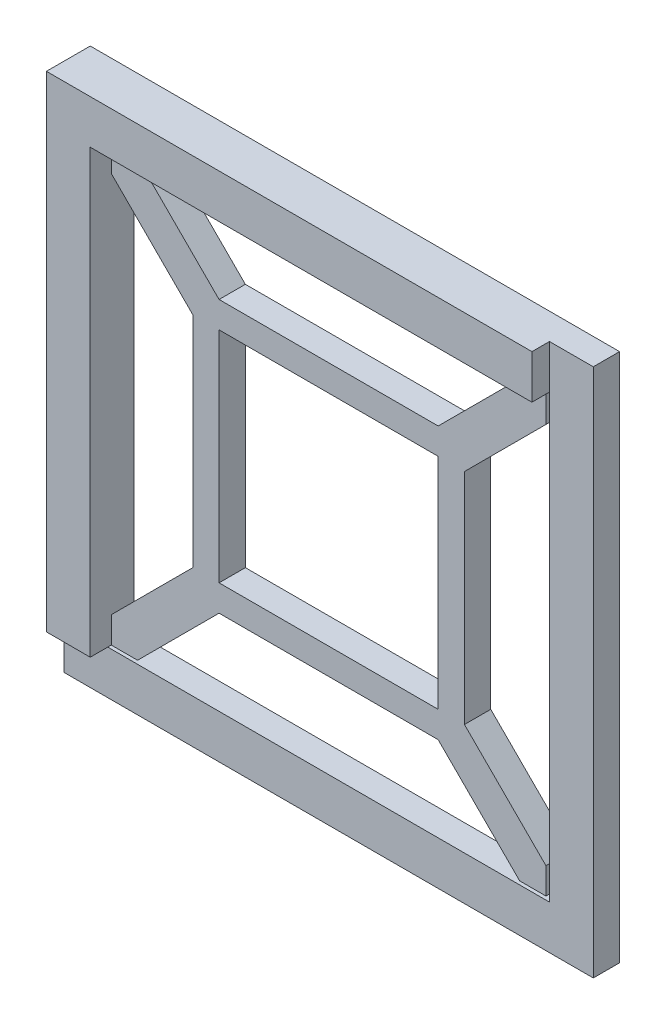
ISO-10303-21;
HEADER;
FILE_DESCRIPTION(('STEP AP214'),'2;1');
FILE_NAME('part.step','',(''),(''),'','','');
FILE_SCHEMA(('AUTOMOTIVE_DESIGN { 1 0 10303 214 1 1 1 1 }'));
ENDSEC;
DATA;
#1=APPLICATION_CONTEXT('core data for automotive mechanical design processes');
#2=APPLICATION_PROTOCOL_DEFINITION('international standard','automotive_design',2000,#1);
#3=PRODUCT_CONTEXT('',#1,'mechanical');
#4=PRODUCT('Part','Part','',(#3));
#5=PRODUCT_RELATED_PRODUCT_CATEGORY('part','',(#4));
#6=PRODUCT_DEFINITION_FORMATION('','',#4);
#7=PRODUCT_DEFINITION_CONTEXT('part definition',#1,'design');
#8=PRODUCT_DEFINITION('design','',#6,#7);
#9=PRODUCT_DEFINITION_SHAPE('','',#8);
#10=(LENGTH_UNIT() NAMED_UNIT(*) SI_UNIT(.MILLI.,.METRE.));
#11=(NAMED_UNIT(*) PLANE_ANGLE_UNIT() SI_UNIT($,.RADIAN.));
#12=(NAMED_UNIT(*) SI_UNIT($,.STERADIAN.) SOLID_ANGLE_UNIT());
#13=UNCERTAINTY_MEASURE_WITH_UNIT(LENGTH_MEASURE(1.E-05),#10,'distance_accuracy_value','');
#14=(GEOMETRIC_REPRESENTATION_CONTEXT(3) GLOBAL_UNCERTAINTY_ASSIGNED_CONTEXT((#13)) GLOBAL_UNIT_ASSIGNED_CONTEXT((#10,
#11,#12)) REPRESENTATION_CONTEXT('',''));
#15=CARTESIAN_POINT('',(0.,0.,0.));
#16=DIRECTION('',(0.,0.,1.));
#17=DIRECTION('',(1.,0.,0.));
#18=AXIS2_PLACEMENT_3D('',#15,#16,#17);
#19=CARTESIAN_POINT('',(0.,15.5,3.));
#20=DIRECTION('',(0.,1.,0.));
#21=DIRECTION('',(0.,0.,1.));
#22=AXIS2_PLACEMENT_3D('',#19,#20,#21);
#23=PLANE('',#22);
#24=DIRECTION('',(1.,0.,0.));
#25=VECTOR('',#24,1.);
#26=CARTESIAN_POINT('',(0.,15.5,3.));
#27=LINE('',#26,#25);
#28=CARTESIAN_POINT('',(-12.4999999999995,15.5,3.));
#29=VERTEX_POINT('',#28);
#30=CARTESIAN_POINT('',(12.5,15.5,3.));
#31=VERTEX_POINT('',#30);
#32=EDGE_CURVE('E381',#29,#31,#27,.T.);
#33=ORIENTED_EDGE('',*,*,#32,.T.);
#34=DIRECTION('',(0.,0.,-1.));
#35=VECTOR('',#34,1.);
#36=CARTESIAN_POINT('',(12.5,15.5,3.));
#37=LINE('',#36,#35);
#38=CARTESIAN_POINT('',(12.5,15.5,0.));
#39=VERTEX_POINT('',#38);
#40=EDGE_CURVE('E266',#31,#39,#37,.T.);
#41=ORIENTED_EDGE('',*,*,#40,.T.);
#42=DIRECTION('',(1.,0.,0.));
#43=VECTOR('',#42,1.);
#44=CARTESIAN_POINT('',(0.,15.5,0.));
#45=LINE('',#44,#43);
#46=CARTESIAN_POINT('',(-12.4999999999995,15.5,0.));
#47=VERTEX_POINT('',#46);
#48=EDGE_CURVE('E391',#47,#39,#45,.T.);
#49=ORIENTED_EDGE('',*,*,#48,.F.);
#50=DIRECTION('',(0.,0.,-1.));
#51=VECTOR('',#50,1.);
#52=CARTESIAN_POINT('',(-12.4999999999995,15.5,3.));
#53=LINE('',#52,#51);
#54=EDGE_CURVE('E325',#29,#47,#53,.T.);
#55=ORIENTED_EDGE('',*,*,#54,.F.);
#56=EDGE_LOOP('',(#33,#41,#49,#55));
#57=FACE_BOUND('',#56,.T.);
#58=ADVANCED_FACE('F93',(#57),#23,.T.);
#59=CARTESIAN_POINT('',(-15.5,0.,3.));
#60=DIRECTION('',(-1.,0.,0.));
#61=DIRECTION('',(0.,0.,1.));
#62=AXIS2_PLACEMENT_3D('',#59,#60,#61);
#63=PLANE('',#62);
#64=DIRECTION('',(0.,1.,0.));
#65=VECTOR('',#64,1.);
#66=CARTESIAN_POINT('',(-15.5,0.,3.));
#67=LINE('',#66,#65);
#68=CARTESIAN_POINT('',(-15.5,-12.4999999999995,3.));
#69=VERTEX_POINT('',#68);
#70=CARTESIAN_POINT('',(-15.5,12.5000000000005,3.));
#71=VERTEX_POINT('',#70);
#72=EDGE_CURVE('E379',#69,#71,#67,.T.);
#73=ORIENTED_EDGE('',*,*,#72,.T.);
#74=DIRECTION('',(0.,0.,-1.));
#75=VECTOR('',#74,1.);
#76=CARTESIAN_POINT('',(-15.5,12.5000000000005,3.));
#77=LINE('',#76,#75);
#78=CARTESIAN_POINT('',(-15.5,12.5000000000005,0.));
#79=VERTEX_POINT('',#78);
#80=EDGE_CURVE('E327',#71,#79,#77,.T.);
#81=ORIENTED_EDGE('',*,*,#80,.T.);
#82=DIRECTION('',(0.,1.,0.));
#83=VECTOR('',#82,1.);
#84=CARTESIAN_POINT('',(-15.5,0.,0.));
#85=LINE('',#84,#83);
#86=CARTESIAN_POINT('',(-15.5,-12.4999999999995,0.));
#87=VERTEX_POINT('',#86);
#88=EDGE_CURVE('E373',#87,#79,#85,.T.);
#89=ORIENTED_EDGE('',*,*,#88,.F.);
#90=DIRECTION('',(0.,0.,-1.));
#91=VECTOR('',#90,1.);
#92=CARTESIAN_POINT('',(-15.5,-12.4999999999995,3.));
#93=LINE('',#92,#91);
#94=EDGE_CURVE('E116',#69,#87,#93,.T.);
#95=ORIENTED_EDGE('',*,*,#94,.F.);
#96=EDGE_LOOP('',(#73,#81,#89,#95));
#97=FACE_BOUND('',#96,.T.);
#98=ADVANCED_FACE('F503',(#97),#63,.T.);
#99=CARTESIAN_POINT('',(0.,-15.5,3.));
#100=DIRECTION('',(0.,1.,0.));
#101=DIRECTION('',(-1.,0.,0.));
#102=AXIS2_PLACEMENT_3D('',#99,#100,#101);
#103=PLANE('',#102);
#104=DIRECTION('',(0.,0.,1.));
#105=VECTOR('',#104,1.);
#106=CARTESIAN_POINT('',(-12.5000000000005,-15.5,3.));
#107=LINE('',#106,#105);
#108=CARTESIAN_POINT('',(-12.5000000000005,-15.5,0.));
#109=VERTEX_POINT('',#108);
#110=CARTESIAN_POINT('',(-12.5000000000005,-15.5,3.));
#111=VERTEX_POINT('',#110);
#112=EDGE_CURVE('E101',#109,#111,#107,.T.);
#113=ORIENTED_EDGE('',*,*,#112,.F.);
#114=DIRECTION('',(1.,0.,0.));
#115=VECTOR('',#114,1.);
#116=CARTESIAN_POINT('',(0.,-15.5,0.));
#117=LINE('',#116,#115);
#118=CARTESIAN_POINT('',(12.4999999999999,-15.5,0.));
#119=VERTEX_POINT('',#118);
#120=EDGE_CURVE('E382',#109,#119,#117,.T.);
#121=ORIENTED_EDGE('',*,*,#120,.T.);
#122=DIRECTION('',(0.,0.,-1.));
#123=VECTOR('',#122,1.);
#124=CARTESIAN_POINT('',(12.4999999999999,-15.5,3.));
#125=LINE('',#124,#123);
#126=CARTESIAN_POINT('',(12.4999999999999,-15.5,3.));
#127=VERTEX_POINT('',#126);
#128=EDGE_CURVE('E398',#127,#119,#125,.T.);
#129=ORIENTED_EDGE('',*,*,#128,.F.);
#130=DIRECTION('',(1.,0.,0.));
#131=VECTOR('',#130,1.);
#132=CARTESIAN_POINT('',(0.,-15.5,3.));
#133=LINE('',#132,#131);
#134=EDGE_CURVE('E386',#111,#127,#133,.T.);
#135=ORIENTED_EDGE('',*,*,#134,.F.);
#136=EDGE_LOOP('',(#113,#121,#129,#135));
#137=FACE_BOUND('',#136,.T.);
#138=ADVANCED_FACE('F461',(#137),#103,.F.);
#139=CARTESIAN_POINT('',(-1.50000000000007,-1.50000000000006,3.));
#140=DIRECTION('',(-0.707106781186548,-0.707106781186547,0.));
#141=DIRECTION('',(0.707106781186547,-0.707106781186548,0.));
#142=AXIS2_PLACEMENT_3D('',#139,#140,#141);
#143=PLANE('',#142);
#144=DIRECTION('',(-0.707106781186547,0.707106781186548,0.));
#145=VECTOR('',#144,1.);
#146=CARTESIAN_POINT('',(-1.50000000000007,-1.50000000000006,3.));
#147=LINE('',#146,#145);
#148=CARTESIAN_POINT('',(21.7999999999998,-24.8,3.));
#149=VERTEX_POINT('',#148);
#150=EDGE_CURVE('E402',#149,#127,#147,.T.);
#151=ORIENTED_EDGE('',*,*,#150,.T.);
#152=ORIENTED_EDGE('',*,*,#128,.T.);
#153=DIRECTION('',(-0.707106781186547,0.707106781186548,0.));
#154=VECTOR('',#153,1.);
#155=CARTESIAN_POINT('',(-1.50000000000007,-1.50000000000006,0.));
#156=LINE('',#155,#154);
#157=CARTESIAN_POINT('',(21.7999999999998,-24.8,0.));
#158=VERTEX_POINT('',#157);
#159=EDGE_CURVE('E401',#158,#119,#156,.T.);
#160=ORIENTED_EDGE('',*,*,#159,.F.);
#161=DIRECTION('',(0.,0.,-1.));
#162=VECTOR('',#161,1.);
#163=CARTESIAN_POINT('',(21.7999999999998,-24.8,3.));
#164=LINE('',#163,#162);
#165=EDGE_CURVE('E438',#149,#158,#164,.T.);
#166=ORIENTED_EDGE('',*,*,#165,.F.);
#167=EDGE_LOOP('',(#151,#152,#160,#166));
#168=FACE_BOUND('',#167,.T.);
#169=ADVANCED_FACE('F95',(#168),#143,.T.);
#170=CARTESIAN_POINT('',(1.49999999999994,1.49999999999994,3.));
#171=DIRECTION('',(-0.707106781186548,-0.707106781186547,0.));
#172=DIRECTION('',(0.707106781186547,-0.707106781186548,0.));
#173=AXIS2_PLACEMENT_3D('',#170,#171,#172);
#174=PLANE('',#173);
#175=DIRECTION('',(0.,0.,-1.));
#176=VECTOR('',#175,1.);
#177=CARTESIAN_POINT('',(15.5,-12.5000000000001,3.));
#178=LINE('',#177,#176);
#179=CARTESIAN_POINT('',(15.5,-12.5000000000001,3.));
#180=VERTEX_POINT('',#179);
#181=CARTESIAN_POINT('',(15.5,-12.5000000000001,0.));
#182=VERTEX_POINT('',#181);
#183=EDGE_CURVE('E388',#180,#182,#178,.T.);
#184=ORIENTED_EDGE('',*,*,#183,.F.);
#185=DIRECTION('',(-0.707106781186547,0.707106781186548,0.));
#186=VECTOR('',#185,1.);
#187=CARTESIAN_POINT('',(1.49999999999994,1.49999999999994,3.));
#188=LINE('',#187,#186);
#189=CARTESIAN_POINT('',(24.8,-21.8000000000001,3.));
#190=VERTEX_POINT('',#189);
#191=EDGE_CURVE('E411',#190,#180,#188,.T.);
#192=ORIENTED_EDGE('',*,*,#191,.F.);
#193=DIRECTION('',(0.,0.,-1.));
#194=VECTOR('',#193,1.);
#195=CARTESIAN_POINT('',(24.8,-21.8000000000001,3.));
#196=LINE('',#195,#194);
#197=CARTESIAN_POINT('',(24.8,-21.8000000000001,0.));
#198=VERTEX_POINT('',#197);
#199=EDGE_CURVE('E434',#190,#198,#196,.T.);
#200=ORIENTED_EDGE('',*,*,#199,.T.);
#201=DIRECTION('',(-0.707106781186547,0.707106781186548,0.));
#202=VECTOR('',#201,1.);
#203=CARTESIAN_POINT('',(1.49999999999994,1.49999999999994,0.));
#204=LINE('',#203,#202);
#205=EDGE_CURVE('E426',#198,#182,#204,.T.);
#206=ORIENTED_EDGE('',*,*,#205,.T.);
#207=EDGE_LOOP('',(#184,#192,#200,#206));
#208=FACE_BOUND('',#207,.T.);
#209=ADVANCED_FACE('F475',(#208),#174,.F.);
#210=CARTESIAN_POINT('',(0.,-24.8,3.));
#211=DIRECTION('',(0.,1.,0.));
#212=DIRECTION('',(0.,0.,1.));
#213=AXIS2_PLACEMENT_3D('',#210,#211,#212);
#214=PLANE('',#213);
#215=DIRECTION('',(1.,0.,0.));
#216=VECTOR('',#215,1.);
#217=CARTESIAN_POINT('',(0.,-24.8,0.));
#218=LINE('',#217,#216);
#219=CARTESIAN_POINT('',(24.8,-24.8,0.));
#220=VERTEX_POINT('',#219);
#221=EDGE_CURVE('E420',#158,#220,#218,.T.);
#222=ORIENTED_EDGE('',*,*,#221,.T.);
#223=DIRECTION('',(0.,0.,-1.));
#224=VECTOR('',#223,1.);
#225=CARTESIAN_POINT('',(24.8,-24.8,3.));
#226=LINE('',#225,#224);
#227=CARTESIAN_POINT('',(24.8,-24.8,3.));
#228=VERTEX_POINT('',#227);
#229=EDGE_CURVE('E436',#228,#220,#226,.T.);
#230=ORIENTED_EDGE('',*,*,#229,.F.);
#231=DIRECTION('',(1.,0.,0.));
#232=VECTOR('',#231,1.);
#233=CARTESIAN_POINT('',(0.,-24.8,3.));
#234=LINE('',#233,#232);
#235=EDGE_CURVE('E405',#149,#228,#234,.T.);
#236=ORIENTED_EDGE('',*,*,#235,.F.);
#237=ORIENTED_EDGE('',*,*,#165,.T.);
#238=EDGE_LOOP('',(#222,#230,#236,#237));
#239=FACE_BOUND('',#238,.T.);
#240=ADVANCED_FACE('F467',(#239),#214,.F.);
#241=CARTESIAN_POINT('',(24.8,0.,3.));
#242=DIRECTION('',(1.,0.,0.));
#243=DIRECTION('',(0.,1.,0.));
#244=AXIS2_PLACEMENT_3D('',#241,#242,#243);
#245=PLANE('',#244);
#246=DIRECTION('',(0.,-1.,0.));
#247=VECTOR('',#246,1.);
#248=CARTESIAN_POINT('',(24.8,0.,0.));
#249=LINE('',#248,#247);
#250=EDGE_CURVE('E423',#198,#220,#249,.T.);
#251=ORIENTED_EDGE('',*,*,#250,.F.);
#252=ORIENTED_EDGE('',*,*,#199,.F.);
#253=DIRECTION('',(0.,-1.,0.));
#254=VECTOR('',#253,1.);
#255=CARTESIAN_POINT('',(24.8,0.,3.));
#256=LINE('',#255,#254);
#257=EDGE_CURVE('E408',#190,#228,#256,.T.);
#258=ORIENTED_EDGE('',*,*,#257,.T.);
#259=ORIENTED_EDGE('',*,*,#229,.T.);
#260=EDGE_LOOP('',(#251,#252,#258,#259));
#261=FACE_BOUND('',#260,.T.);
#262=ADVANCED_FACE('F470',(#261),#245,.T.);
#263=CARTESIAN_POINT('',(12.5,0.,3.));
#264=DIRECTION('',(-1.,0.,0.));
#265=DIRECTION('',(0.,0.,1.));
#266=AXIS2_PLACEMENT_3D('',#263,#264,#265);
#267=PLANE('',#266);
#268=DIRECTION('',(0.,1.,0.));
#269=VECTOR('',#268,1.);
#270=CARTESIAN_POINT('',(12.5,0.,3.));
#271=LINE('',#270,#269);
#272=CARTESIAN_POINT('',(12.5,-12.5,3.));
#273=VERTEX_POINT('',#272);
#274=CARTESIAN_POINT('',(12.5,12.5,3.));
#275=VERTEX_POINT('',#274);
#276=EDGE_CURVE('E413',#273,#275,#271,.T.);
#277=ORIENTED_EDGE('',*,*,#276,.T.);
#278=DIRECTION('',(0.,0.,-1.));
#279=VECTOR('',#278,1.);
#280=CARTESIAN_POINT('',(12.5,12.5,3.));
#281=LINE('',#280,#279);
#282=CARTESIAN_POINT('',(12.5,12.5,0.));
#283=VERTEX_POINT('',#282);
#284=EDGE_CURVE('E374',#275,#283,#281,.T.);
#285=ORIENTED_EDGE('',*,*,#284,.T.);
#286=DIRECTION('',(0.,1.,0.));
#287=VECTOR('',#286,1.);
#288=CARTESIAN_POINT('',(12.5,0.,0.));
#289=LINE('',#288,#287);
#290=CARTESIAN_POINT('',(12.5,-12.5,0.));
#291=VERTEX_POINT('',#290);
#292=EDGE_CURVE('E429',#291,#283,#289,.T.);
#293=ORIENTED_EDGE('',*,*,#292,.F.);
#294=DIRECTION('',(0.,0.,-1.));
#295=VECTOR('',#294,1.);
#296=CARTESIAN_POINT('',(12.5,-12.5,3.));
#297=LINE('',#296,#295);
#298=EDGE_CURVE('E417',#273,#291,#297,.T.);
#299=ORIENTED_EDGE('',*,*,#298,.F.);
#300=EDGE_LOOP('',(#277,#285,#293,#299));
#301=FACE_BOUND('',#300,.T.);
#302=ADVANCED_FACE('F534',(#301),#267,.T.);
#303=CARTESIAN_POINT('',(0.,-12.5,3.));
#304=DIRECTION('',(0.,1.,0.));
#305=DIRECTION('',(-1.,0.,0.));
#306=AXIS2_PLACEMENT_3D('',#303,#304,#305);
#307=PLANE('',#306);
#308=DIRECTION('',(1.,0.,0.));
#309=VECTOR('',#308,1.);
#310=CARTESIAN_POINT('',(0.,-12.5,3.));
#311=LINE('',#310,#309);
#312=CARTESIAN_POINT('',(-12.5,-12.5,3.));
#313=VERTEX_POINT('',#312);
#314=EDGE_CURVE('E415',#313,#273,#311,.T.);
#315=ORIENTED_EDGE('',*,*,#314,.T.);
#316=ORIENTED_EDGE('',*,*,#298,.T.);
#317=DIRECTION('',(1.,0.,0.));
#318=VECTOR('',#317,1.);
#319=CARTESIAN_POINT('',(0.,-12.5,0.));
#320=LINE('',#319,#318);
#321=CARTESIAN_POINT('',(-12.5,-12.5,0.));
#322=VERTEX_POINT('',#321);
#323=EDGE_CURVE('E406',#322,#291,#320,.T.);
#324=ORIENTED_EDGE('',*,*,#323,.F.);
#325=DIRECTION('',(0.,0.,-1.));
#326=VECTOR('',#325,1.);
#327=CARTESIAN_POINT('',(-12.5,-12.5,3.));
#328=LINE('',#327,#326);
#329=EDGE_CURVE('E370',#313,#322,#328,.T.);
#330=ORIENTED_EDGE('',*,*,#329,.F.);
#331=EDGE_LOOP('',(#315,#316,#324,#330));
#332=FACE_BOUND('',#331,.T.);
#333=ADVANCED_FACE('F529',(#332),#307,.T.);
#334=CARTESIAN_POINT('',(0.,0.,3.));
#335=DIRECTION('',(0.,0.,1.));
#336=DIRECTION('',(1.,0.,0.));
#337=AXIS2_PLACEMENT_3D('',#334,#335,#336);
#338=PLANE('',#337);
#339=DIRECTION('',(0.,1.,0.));
#340=VECTOR('',#339,1.);
#341=CARTESIAN_POINT('',(15.5,0.,3.));
#342=LINE('',#341,#340);
#343=CARTESIAN_POINT('',(15.5,12.5,3.));
#344=VERTEX_POINT('',#343);
#345=EDGE_CURVE('E278',#180,#344,#342,.T.);
#346=ORIENTED_EDGE('',*,*,#345,.T.);
#347=DIRECTION('',(-0.707106781186547,-0.707106781186548,0.));
#348=VECTOR('',#347,1.);
#349=CARTESIAN_POINT('',(1.5,-1.5,3.));
#350=LINE('',#349,#348);
#351=CARTESIAN_POINT('',(24.8,21.8,3.));
#352=VERTEX_POINT('',#351);
#353=EDGE_CURVE('E259',#352,#344,#350,.T.);
#354=ORIENTED_EDGE('',*,*,#353,.F.);
#355=DIRECTION('',(0.,-1.,0.));
#356=VECTOR('',#355,1.);
#357=CARTESIAN_POINT('',(24.8,0.,3.));
#358=LINE('',#357,#356);
#359=CARTESIAN_POINT('',(24.8,24.8,3.));
#360=VERTEX_POINT('',#359);
#361=EDGE_CURVE('E275',#360,#352,#358,.T.);
#362=ORIENTED_EDGE('',*,*,#361,.F.);
#363=DIRECTION('',(1.,0.,0.));
#364=VECTOR('',#363,1.);
#365=CARTESIAN_POINT('',(0.,24.8,3.));
#366=LINE('',#365,#364);
#367=CARTESIAN_POINT('',(21.8,24.8,3.));
#368=VERTEX_POINT('',#367);
#369=EDGE_CURVE('E282',#368,#360,#366,.T.);
#370=ORIENTED_EDGE('',*,*,#369,.F.);
#371=DIRECTION('',(-0.707106781186548,-0.707106781186547,0.));
#372=VECTOR('',#371,1.);
#373=CARTESIAN_POINT('',(-1.50000000000001,1.50000000000001,3.));
#374=LINE('',#373,#372);
#375=EDGE_CURVE('E284',#368,#31,#374,.T.);
#376=ORIENTED_EDGE('',*,*,#375,.T.);
#377=ORIENTED_EDGE('',*,*,#32,.F.);
#378=DIRECTION('',(0.707106781186547,-0.707106781186548,0.));
#379=VECTOR('',#378,1.);
#380=CARTESIAN_POINT('',(1.50000000000022,1.50000000000022,3.));
#381=LINE('',#380,#379);
#382=CARTESIAN_POINT('',(-21.7999999999995,24.8,3.));
#383=VERTEX_POINT('',#382);
#384=EDGE_CURVE('E301',#383,#29,#381,.T.);
#385=ORIENTED_EDGE('',*,*,#384,.F.);
#386=DIRECTION('',(1.,0.,0.));
#387=VECTOR('',#386,1.);
#388=CARTESIAN_POINT('',(0.,24.8,3.));
#389=LINE('',#388,#387);
#390=CARTESIAN_POINT('',(-24.8,24.8,3.));
#391=VERTEX_POINT('',#390);
#392=EDGE_CURVE('E303',#391,#383,#389,.T.);
#393=ORIENTED_EDGE('',*,*,#392,.F.);
#394=DIRECTION('',(0.,-1.,0.));
#395=VECTOR('',#394,1.);
#396=CARTESIAN_POINT('',(-24.8,0.,3.));
#397=LINE('',#396,#395);
#398=CARTESIAN_POINT('',(-24.8,21.8000000000005,3.));
#399=VERTEX_POINT('',#398);
#400=EDGE_CURVE('E307',#391,#399,#397,.T.);
#401=ORIENTED_EDGE('',*,*,#400,.T.);
#402=DIRECTION('',(0.707106781186547,-0.707106781186548,0.));
#403=VECTOR('',#402,1.);
#404=CARTESIAN_POINT('',(-1.49999999999979,-1.49999999999978,3.));
#405=LINE('',#404,#403);
#406=EDGE_CURVE('E309',#399,#71,#405,.T.);
#407=ORIENTED_EDGE('',*,*,#406,.T.);
#408=ORIENTED_EDGE('',*,*,#72,.F.);
#409=DIRECTION('',(0.707106781186539,0.707106781186556,0.));
#410=VECTOR('',#409,1.);
#411=CARTESIAN_POINT('',(-1.50000000000046,1.50000000000042,3.));
#412=LINE('',#411,#410);
#413=CARTESIAN_POINT('',(-24.8,-21.7999999999997,3.));
#414=VERTEX_POINT('',#413);
#415=EDGE_CURVE('E331',#414,#69,#412,.T.);
#416=ORIENTED_EDGE('',*,*,#415,.F.);
#417=DIRECTION('',(0.,-1.,0.));
#418=VECTOR('',#417,1.);
#419=CARTESIAN_POINT('',(-24.8,0.,3.));
#420=LINE('',#419,#418);
#421=CARTESIAN_POINT('',(-24.8,-24.8,3.));
#422=VERTEX_POINT('',#421);
#423=EDGE_CURVE('E334',#414,#422,#420,.T.);
#424=ORIENTED_EDGE('',*,*,#423,.T.);
#425=DIRECTION('',(1.,0.,0.));
#426=VECTOR('',#425,1.);
#427=CARTESIAN_POINT('',(0.,-24.8,3.));
#428=LINE('',#427,#426);
#429=CARTESIAN_POINT('',(-21.8000000000003,-24.8,3.));
#430=VERTEX_POINT('',#429);
#431=EDGE_CURVE('E337',#422,#430,#428,.T.);
#432=ORIENTED_EDGE('',*,*,#431,.T.);
#433=DIRECTION('',(0.707106781186539,0.707106781186556,0.));
#434=VECTOR('',#433,1.);
#435=CARTESIAN_POINT('',(1.49999999999958,-1.49999999999954,3.));
#436=LINE('',#435,#434);
#437=EDGE_CURVE('E339',#430,#111,#436,.T.);
#438=ORIENTED_EDGE('',*,*,#437,.T.);
#439=ORIENTED_EDGE('',*,*,#134,.T.);
#440=ORIENTED_EDGE('',*,*,#150,.F.);
#441=ORIENTED_EDGE('',*,*,#235,.T.);
#442=ORIENTED_EDGE('',*,*,#257,.F.);
#443=ORIENTED_EDGE('',*,*,#191,.T.);
#444=EDGE_LOOP('',(#346,#354,#362,#370,#376,#377,#385,#393,#401,#407,#408,#416,#424,#432,#438,
#439,#440,#441,#442,#443));
#445=FACE_BOUND('',#444,.T.);
#446=DIRECTION('',(1.,0.,0.));
#447=VECTOR('',#446,1.);
#448=CARTESIAN_POINT('',(-12.5,12.5,3.));
#449=LINE('',#448,#447);
#450=CARTESIAN_POINT('',(-12.5,12.5,3.));
#451=VERTEX_POINT('',#450);
#452=EDGE_CURVE('E362',#451,#275,#449,.T.);
#453=ORIENTED_EDGE('',*,*,#452,.T.);
#454=ORIENTED_EDGE('',*,*,#276,.F.);
#455=ORIENTED_EDGE('',*,*,#314,.F.);
#456=DIRECTION('',(0.,1.,0.));
#457=VECTOR('',#456,1.);
#458=CARTESIAN_POINT('',(-12.5,-12.5,3.));
#459=LINE('',#458,#457);
#460=EDGE_CURVE('E360',#313,#451,#459,.T.);
#461=ORIENTED_EDGE('',*,*,#460,.T.);
#462=EDGE_LOOP('',(#453,#454,#455,#461));
#463=FACE_BOUND('',#462,.T.);
#464=ADVANCED_FACE('F272',(#445,#463),#338,.T.);
#465=CARTESIAN_POINT('',(0.,0.,0.));
#466=DIRECTION('',(0.,0.,1.));
#467=DIRECTION('',(1.,0.,0.));
#468=AXIS2_PLACEMENT_3D('',#465,#466,#467);
#469=PLANE('',#468);
#470=DIRECTION('',(-0.707106781186547,-0.707106781186548,0.));
#471=VECTOR('',#470,1.);
#472=CARTESIAN_POINT('',(1.5,-1.5,0.));
#473=LINE('',#472,#471);
#474=CARTESIAN_POINT('',(24.8,21.8,0.));
#475=VERTEX_POINT('',#474);
#476=CARTESIAN_POINT('',(15.5,12.5,0.));
#477=VERTEX_POINT('',#476);
#478=EDGE_CURVE('E261',#475,#477,#473,.T.);
#479=ORIENTED_EDGE('',*,*,#478,.T.);
#480=DIRECTION('',(0.,1.,0.));
#481=VECTOR('',#480,1.);
#482=CARTESIAN_POINT('',(15.5,0.,0.));
#483=LINE('',#482,#481);
#484=EDGE_CURVE('E393',#182,#477,#483,.T.);
#485=ORIENTED_EDGE('',*,*,#484,.F.);
#486=ORIENTED_EDGE('',*,*,#205,.F.);
#487=ORIENTED_EDGE('',*,*,#250,.T.);
#488=ORIENTED_EDGE('',*,*,#221,.F.);
#489=ORIENTED_EDGE('',*,*,#159,.T.);
#490=ORIENTED_EDGE('',*,*,#120,.F.);
#491=DIRECTION('',(0.707106781186539,0.707106781186556,0.));
#492=VECTOR('',#491,1.);
#493=CARTESIAN_POINT('',(1.49999999999958,-1.49999999999954,0.));
#494=LINE('',#493,#492);
#495=CARTESIAN_POINT('',(-21.8000000000003,-24.8,0.));
#496=VERTEX_POINT('',#495);
#497=EDGE_CURVE('E335',#496,#109,#494,.T.);
#498=ORIENTED_EDGE('',*,*,#497,.F.);
#499=DIRECTION('',(1.,0.,0.));
#500=VECTOR('',#499,1.);
#501=CARTESIAN_POINT('',(0.,-24.8,0.));
#502=LINE('',#501,#500);
#503=CARTESIAN_POINT('',(-24.8,-24.8,0.));
#504=VERTEX_POINT('',#503);
#505=EDGE_CURVE('E347',#504,#496,#502,.T.);
#506=ORIENTED_EDGE('',*,*,#505,.F.);
#507=DIRECTION('',(0.,-1.,0.));
#508=VECTOR('',#507,1.);
#509=CARTESIAN_POINT('',(-24.8,0.,0.));
#510=LINE('',#509,#508);
#511=CARTESIAN_POINT('',(-24.8,-21.7999999999997,0.));
#512=VERTEX_POINT('',#511);
#513=EDGE_CURVE('E345',#512,#504,#510,.T.);
#514=ORIENTED_EDGE('',*,*,#513,.F.);
#515=DIRECTION('',(0.707106781186539,0.707106781186556,0.));
#516=VECTOR('',#515,1.);
#517=CARTESIAN_POINT('',(-1.50000000000046,1.50000000000042,0.));
#518=LINE('',#517,#516);
#519=EDGE_CURVE('E330',#512,#87,#518,.T.);
#520=ORIENTED_EDGE('',*,*,#519,.T.);
#521=ORIENTED_EDGE('',*,*,#88,.T.);
#522=DIRECTION('',(0.707106781186547,-0.707106781186548,0.));
#523=VECTOR('',#522,1.);
#524=CARTESIAN_POINT('',(-1.49999999999979,-1.49999999999978,0.));
#525=LINE('',#524,#523);
#526=CARTESIAN_POINT('',(-24.8,21.8000000000005,0.));
#527=VERTEX_POINT('',#526);
#528=EDGE_CURVE('E304',#527,#79,#525,.T.);
#529=ORIENTED_EDGE('',*,*,#528,.F.);
#530=DIRECTION('',(0.,-1.,0.));
#531=VECTOR('',#530,1.);
#532=CARTESIAN_POINT('',(-24.8,0.,0.));
#533=LINE('',#532,#531);
#534=CARTESIAN_POINT('',(-24.8,24.8,0.));
#535=VERTEX_POINT('',#534);
#536=EDGE_CURVE('E316',#535,#527,#533,.T.);
#537=ORIENTED_EDGE('',*,*,#536,.F.);
#538=DIRECTION('',(1.,0.,0.));
#539=VECTOR('',#538,1.);
#540=CARTESIAN_POINT('',(0.,24.8,0.));
#541=LINE('',#540,#539);
#542=CARTESIAN_POINT('',(-21.7999999999995,24.8,0.));
#543=VERTEX_POINT('',#542);
#544=EDGE_CURVE('E314',#535,#543,#541,.T.);
#545=ORIENTED_EDGE('',*,*,#544,.T.);
#546=DIRECTION('',(0.707106781186547,-0.707106781186548,0.));
#547=VECTOR('',#546,1.);
#548=CARTESIAN_POINT('',(1.50000000000022,1.50000000000022,0.));
#549=LINE('',#548,#547);
#550=EDGE_CURVE('E108',#543,#47,#549,.T.);
#551=ORIENTED_EDGE('',*,*,#550,.T.);
#552=ORIENTED_EDGE('',*,*,#48,.T.);
#553=DIRECTION('',(-0.707106781186548,-0.707106781186547,0.));
#554=VECTOR('',#553,1.);
#555=CARTESIAN_POINT('',(-1.50000000000001,1.50000000000001,0.));
#556=LINE('',#555,#554);
#557=CARTESIAN_POINT('',(21.8,24.8,0.));
#558=VERTEX_POINT('',#557);
#559=EDGE_CURVE('E279',#558,#39,#556,.T.);
#560=ORIENTED_EDGE('',*,*,#559,.F.);
#561=DIRECTION('',(1.,0.,0.));
#562=VECTOR('',#561,1.);
#563=CARTESIAN_POINT('',(0.,24.8,0.));
#564=LINE('',#563,#562);
#565=CARTESIAN_POINT('',(24.8,24.8,0.));
#566=VERTEX_POINT('',#565);
#567=EDGE_CURVE('E293',#558,#566,#564,.T.);
#568=ORIENTED_EDGE('',*,*,#567,.T.);
#569=DIRECTION('',(0.,-1.,0.));
#570=VECTOR('',#569,1.);
#571=CARTESIAN_POINT('',(24.8,0.,0.));
#572=LINE('',#571,#570);
#573=EDGE_CURVE('E291',#566,#475,#572,.T.);
#574=ORIENTED_EDGE('',*,*,#573,.T.);
#575=EDGE_LOOP('',(#479,#485,#486,#487,#488,#489,#490,#498,#506,#514,#520,#521,#529,#537,#545,
#551,#552,#560,#568,#574));
#576=FACE_BOUND('',#575,.T.);
#577=ORIENTED_EDGE('',*,*,#292,.T.);
#578=DIRECTION('',(1.,0.,0.));
#579=VECTOR('',#578,1.);
#580=CARTESIAN_POINT('',(-12.5,12.5,0.));
#581=LINE('',#580,#579);
#582=CARTESIAN_POINT('',(-12.5,12.5,0.));
#583=VERTEX_POINT('',#582);
#584=EDGE_CURVE('E363',#583,#283,#581,.T.);
#585=ORIENTED_EDGE('',*,*,#584,.F.);
#586=DIRECTION('',(0.,1.,0.));
#587=VECTOR('',#586,1.);
#588=CARTESIAN_POINT('',(-12.5,-12.5,0.));
#589=LINE('',#588,#587);
#590=EDGE_CURVE('E359',#322,#583,#589,.T.);
#591=ORIENTED_EDGE('',*,*,#590,.F.);
#592=ORIENTED_EDGE('',*,*,#323,.T.);
#593=EDGE_LOOP('',(#577,#585,#591,#592));
#594=FACE_BOUND('',#593,.T.);
#595=ADVANCED_FACE('F455',(#576,#594),#469,.F.);
#596=CARTESIAN_POINT('',(15.5,0.,3.));
#597=DIRECTION('',(-1.,0.,0.));
#598=DIRECTION('',(0.,0.,1.));
#599=AXIS2_PLACEMENT_3D('',#596,#597,#598);
#600=PLANE('',#599);
#601=ORIENTED_EDGE('',*,*,#484,.T.);
#602=DIRECTION('',(0.,0.,1.));
#603=VECTOR('',#602,1.);
#604=CARTESIAN_POINT('',(15.5,12.5,3.));
#605=LINE('',#604,#603);
#606=EDGE_CURVE('E13',#477,#344,#605,.T.);
#607=ORIENTED_EDGE('',*,*,#606,.T.);
#608=ORIENTED_EDGE('',*,*,#345,.F.);
#609=ORIENTED_EDGE('',*,*,#183,.T.);
#610=EDGE_LOOP('',(#601,#607,#608,#609));
#611=FACE_BOUND('',#610,.T.);
#612=ADVANCED_FACE('F478',(#611),#600,.F.);
#613=CARTESIAN_POINT('',(-12.5,-12.5,3.));
#614=DIRECTION('',(-1.,0.,0.));
#615=DIRECTION('',(0.,0.,1.));
#616=AXIS2_PLACEMENT_3D('',#613,#614,#615);
#617=PLANE('',#616);
#618=DIRECTION('',(0.,0.,-1.));
#619=VECTOR('',#618,1.);
#620=CARTESIAN_POINT('',(-12.5,12.5,3.));
#621=LINE('',#620,#619);
#622=EDGE_CURVE('E366',#451,#583,#621,.T.);
#623=ORIENTED_EDGE('',*,*,#622,.F.);
#624=ORIENTED_EDGE('',*,*,#460,.F.);
#625=ORIENTED_EDGE('',*,*,#329,.T.);
#626=ORIENTED_EDGE('',*,*,#590,.T.);
#627=EDGE_LOOP('',(#623,#624,#625,#626));
#628=FACE_BOUND('',#627,.T.);
#629=ADVANCED_FACE('F574',(#628),#617,.F.);
#630=CARTESIAN_POINT('',(-12.5,12.5,3.));
#631=DIRECTION('',(0.,1.,0.));
#632=DIRECTION('',(0.,0.,1.));
#633=AXIS2_PLACEMENT_3D('',#630,#631,#632);
#634=PLANE('',#633);
#635=ORIENTED_EDGE('',*,*,#284,.F.);
#636=ORIENTED_EDGE('',*,*,#452,.F.);
#637=ORIENTED_EDGE('',*,*,#622,.T.);
#638=ORIENTED_EDGE('',*,*,#584,.T.);
#639=EDGE_LOOP('',(#635,#636,#637,#638));
#640=FACE_BOUND('',#639,.T.);
#641=ADVANCED_FACE('F580',(#640),#634,.F.);
#642=CARTESIAN_POINT('',(1.49999999999958,-1.49999999999954,3.));
#643=DIRECTION('',(-0.707106781186556,0.707106781186539,0.));
#644=DIRECTION('',(-0.707106781186539,-0.707106781186556,0.));
#645=AXIS2_PLACEMENT_3D('',#642,#643,#644);
#646=PLANE('',#645);
#647=ORIENTED_EDGE('',*,*,#497,.T.);
#648=ORIENTED_EDGE('',*,*,#112,.T.);
#649=ORIENTED_EDGE('',*,*,#437,.F.);
#650=DIRECTION('',(0.,0.,-1.));
#651=VECTOR('',#650,1.);
#652=CARTESIAN_POINT('',(-21.8000000000003,-24.8,3.));
#653=LINE('',#652,#651);
#654=EDGE_CURVE('E342',#430,#496,#653,.T.);
#655=ORIENTED_EDGE('',*,*,#654,.T.);
#656=EDGE_LOOP('',(#647,#648,#649,#655));
#657=FACE_BOUND('',#656,.T.);
#658=ADVANCED_FACE('F443',(#657),#646,.F.);
#659=CARTESIAN_POINT('',(-1.50000000000046,1.50000000000042,3.));
#660=DIRECTION('',(-0.707106781186556,0.707106781186539,0.));
#661=DIRECTION('',(-0.707106781186539,-0.707106781186556,0.));
#662=AXIS2_PLACEMENT_3D('',#659,#660,#661);
#663=PLANE('',#662);
#664=ORIENTED_EDGE('',*,*,#415,.T.);
#665=ORIENTED_EDGE('',*,*,#94,.T.);
#666=ORIENTED_EDGE('',*,*,#519,.F.);
#667=DIRECTION('',(0.,0.,-1.));
#668=VECTOR('',#667,1.);
#669=CARTESIAN_POINT('',(-24.8,-21.7999999999997,3.));
#670=LINE('',#669,#668);
#671=EDGE_CURVE('E356',#414,#512,#670,.T.);
#672=ORIENTED_EDGE('',*,*,#671,.F.);
#673=EDGE_LOOP('',(#664,#665,#666,#672));
#674=FACE_BOUND('',#673,.T.);
#675=ADVANCED_FACE('F507',(#674),#663,.T.);
#676=CARTESIAN_POINT('',(-24.8,0.,3.));
#677=DIRECTION('',(1.,0.,0.));
#678=DIRECTION('',(0.,1.,0.));
#679=AXIS2_PLACEMENT_3D('',#676,#677,#678);
#680=PLANE('',#679);
#681=ORIENTED_EDGE('',*,*,#513,.T.);
#682=DIRECTION('',(0.,0.,-1.));
#683=VECTOR('',#682,1.);
#684=CARTESIAN_POINT('',(-24.8,-24.8,3.));
#685=LINE('',#684,#683);
#686=EDGE_CURVE('E353',#422,#504,#685,.T.);
#687=ORIENTED_EDGE('',*,*,#686,.F.);
#688=ORIENTED_EDGE('',*,*,#423,.F.);
#689=ORIENTED_EDGE('',*,*,#671,.T.);
#690=EDGE_LOOP('',(#681,#687,#688,#689));
#691=FACE_BOUND('',#690,.T.);
#692=ADVANCED_FACE('F509',(#691),#680,.F.);
#693=CARTESIAN_POINT('',(0.,-24.8,3.));
#694=DIRECTION('',(0.,1.,0.));
#695=DIRECTION('',(0.,0.,1.));
#696=AXIS2_PLACEMENT_3D('',#693,#694,#695);
#697=PLANE('',#696);
#698=ORIENTED_EDGE('',*,*,#505,.T.);
#699=ORIENTED_EDGE('',*,*,#654,.F.);
#700=ORIENTED_EDGE('',*,*,#431,.F.);
#701=ORIENTED_EDGE('',*,*,#686,.T.);
#702=EDGE_LOOP('',(#698,#699,#700,#701));
#703=FACE_BOUND('',#702,.T.);
#704=ADVANCED_FACE('F453',(#703),#697,.F.);
#705=CARTESIAN_POINT('',(1.50000000000022,1.50000000000022,3.));
#706=DIRECTION('',(0.707106781186548,0.707106781186547,0.));
#707=DIRECTION('',(-0.707106781186547,0.707106781186548,0.));
#708=AXIS2_PLACEMENT_3D('',#705,#706,#707);
#709=PLANE('',#708);
#710=ORIENTED_EDGE('',*,*,#384,.T.);
#711=ORIENTED_EDGE('',*,*,#54,.T.);
#712=ORIENTED_EDGE('',*,*,#550,.F.);
#713=DIRECTION('',(0.,0.,-1.));
#714=VECTOR('',#713,1.);
#715=CARTESIAN_POINT('',(-21.7999999999995,24.8,3.));
#716=LINE('',#715,#714);
#717=EDGE_CURVE('E323',#383,#543,#716,.T.);
#718=ORIENTED_EDGE('',*,*,#717,.F.);
#719=EDGE_LOOP('',(#710,#711,#712,#718));
#720=FACE_BOUND('',#719,.T.);
#721=ADVANCED_FACE('F491',(#720),#709,.T.);
#722=CARTESIAN_POINT('',(0.,24.8,3.));
#723=DIRECTION('',(0.,1.,0.));
#724=DIRECTION('',(0.,0.,1.));
#725=AXIS2_PLACEMENT_3D('',#722,#723,#724);
#726=PLANE('',#725);
#727=ORIENTED_EDGE('',*,*,#544,.F.);
#728=DIRECTION('',(0.,0.,-1.));
#729=VECTOR('',#728,1.);
#730=CARTESIAN_POINT('',(-24.8,24.8,3.));
#731=LINE('',#730,#729);
#732=EDGE_CURVE('E321',#391,#535,#731,.T.);
#733=ORIENTED_EDGE('',*,*,#732,.F.);
#734=ORIENTED_EDGE('',*,*,#392,.T.);
#735=ORIENTED_EDGE('',*,*,#717,.T.);
#736=EDGE_LOOP('',(#727,#733,#734,#735));
#737=FACE_BOUND('',#736,.T.);
#738=ADVANCED_FACE('F495',(#737),#726,.T.);
#739=CARTESIAN_POINT('',(-24.8,0.,3.));
#740=DIRECTION('',(1.,0.,0.));
#741=DIRECTION('',(0.,1.,0.));
#742=AXIS2_PLACEMENT_3D('',#739,#740,#741);
#743=PLANE('',#742);
#744=ORIENTED_EDGE('',*,*,#536,.T.);
#745=DIRECTION('',(0.,0.,-1.));
#746=VECTOR('',#745,1.);
#747=CARTESIAN_POINT('',(-24.8,21.8000000000005,3.));
#748=LINE('',#747,#746);
#749=EDGE_CURVE('E312',#399,#527,#748,.T.);
#750=ORIENTED_EDGE('',*,*,#749,.F.);
#751=ORIENTED_EDGE('',*,*,#400,.F.);
#752=ORIENTED_EDGE('',*,*,#732,.T.);
#753=EDGE_LOOP('',(#744,#750,#751,#752));
#754=FACE_BOUND('',#753,.T.);
#755=ADVANCED_FACE('F500',(#754),#743,.F.);
#756=CARTESIAN_POINT('',(-1.49999999999979,-1.49999999999978,3.));
#757=DIRECTION('',(0.707106781186548,0.707106781186547,0.));
#758=DIRECTION('',(-0.707106781186547,0.707106781186548,0.));
#759=AXIS2_PLACEMENT_3D('',#756,#757,#758);
#760=PLANE('',#759);
#761=ORIENTED_EDGE('',*,*,#80,.F.);
#762=ORIENTED_EDGE('',*,*,#406,.F.);
#763=ORIENTED_EDGE('',*,*,#749,.T.);
#764=ORIENTED_EDGE('',*,*,#528,.T.);
#765=EDGE_LOOP('',(#761,#762,#763,#764));
#766=FACE_BOUND('',#765,.T.);
#767=ADVANCED_FACE('F636',(#766),#760,.F.);
#768=CARTESIAN_POINT('',(1.5,-1.5,3.));
#769=DIRECTION('',(0.707106781186548,-0.707106781186547,0.));
#770=DIRECTION('',(0.707106781186547,0.707106781186548,0.));
#771=AXIS2_PLACEMENT_3D('',#768,#769,#770);
#772=PLANE('',#771);
#773=ORIENTED_EDGE('',*,*,#606,.F.);
#774=ORIENTED_EDGE('',*,*,#478,.F.);
#775=DIRECTION('',(0.,0.,-1.));
#776=VECTOR('',#775,1.);
#777=CARTESIAN_POINT('',(24.8,21.8,3.));
#778=LINE('',#777,#776);
#779=EDGE_CURVE('E256',#352,#475,#778,.T.);
#780=ORIENTED_EDGE('',*,*,#779,.F.);
#781=ORIENTED_EDGE('',*,*,#353,.T.);
#782=EDGE_LOOP('',(#773,#774,#780,#781));
#783=FACE_BOUND('',#782,.T.);
#784=ADVANCED_FACE('F258',(#783),#772,.T.);
#785=CARTESIAN_POINT('',(24.8,0.,3.));
#786=DIRECTION('',(1.,0.,0.));
#787=DIRECTION('',(0.,1.,0.));
#788=AXIS2_PLACEMENT_3D('',#785,#786,#787);
#789=PLANE('',#788);
#790=ORIENTED_EDGE('',*,*,#573,.F.);
#791=DIRECTION('',(0.,0.,-1.));
#792=VECTOR('',#791,1.);
#793=CARTESIAN_POINT('',(24.8,24.8,3.));
#794=LINE('',#793,#792);
#795=EDGE_CURVE('E267',#360,#566,#794,.T.);
#796=ORIENTED_EDGE('',*,*,#795,.F.);
#797=ORIENTED_EDGE('',*,*,#361,.T.);
#798=ORIENTED_EDGE('',*,*,#779,.T.);
#799=EDGE_LOOP('',(#790,#796,#797,#798));
#800=FACE_BOUND('',#799,.T.);
#801=ADVANCED_FACE('F281',(#800),#789,.T.);
#802=CARTESIAN_POINT('',(0.,24.8,3.));
#803=DIRECTION('',(0.,1.,0.));
#804=DIRECTION('',(0.,0.,1.));
#805=AXIS2_PLACEMENT_3D('',#802,#803,#804);
#806=PLANE('',#805);
#807=ORIENTED_EDGE('',*,*,#567,.F.);
#808=DIRECTION('',(0.,0.,-1.));
#809=VECTOR('',#808,1.);
#810=CARTESIAN_POINT('',(21.8,24.8,3.));
#811=LINE('',#810,#809);
#812=EDGE_CURVE('E289',#368,#558,#811,.T.);
#813=ORIENTED_EDGE('',*,*,#812,.F.);
#814=ORIENTED_EDGE('',*,*,#369,.T.);
#815=ORIENTED_EDGE('',*,*,#795,.T.);
#816=EDGE_LOOP('',(#807,#813,#814,#815));
#817=FACE_BOUND('',#816,.T.);
#818=ADVANCED_FACE('F482',(#817),#806,.T.);
#819=CARTESIAN_POINT('',(-1.50000000000001,1.50000000000001,3.));
#820=DIRECTION('',(0.707106781186547,-0.707106781186548,0.));
#821=DIRECTION('',(0.707106781186548,0.707106781186547,0.));
#822=AXIS2_PLACEMENT_3D('',#819,#820,#821);
#823=PLANE('',#822);
#824=ORIENTED_EDGE('',*,*,#40,.F.);
#825=ORIENTED_EDGE('',*,*,#375,.F.);
#826=ORIENTED_EDGE('',*,*,#812,.T.);
#827=ORIENTED_EDGE('',*,*,#559,.T.);
#828=EDGE_LOOP('',(#824,#825,#826,#827));
#829=FACE_BOUND('',#828,.T.);
#830=ADVANCED_FACE('F671',(#829),#823,.F.);
#831=CLOSED_SHELL('',(#58,#98,#138,#169,#209,#240,#262,#302,#333,#464,#595,#612,#629,#641,#658,
#675,#692,#704,#721,#738,#755,#767,#784,#801,#818,#830));
#832=MANIFOLD_SOLID_BREP('B2',#831);
#833=CARTESIAN_POINT('',(0.,0.,3.));
#834=DIRECTION('',(0.,0.,1.));
#835=DIRECTION('',(1.,0.,0.));
#836=AXIS2_PLACEMENT_3D('',#833,#834,#835);
#837=PLANE('',#836);
#838=DIRECTION('',(1.,0.,0.));
#839=VECTOR('',#838,1.);
#840=CARTESIAN_POINT('',(-25.2,30.2,3.));
#841=LINE('',#840,#839);
#842=CARTESIAN_POINT('',(25.2,30.2,3.));
#843=VERTEX_POINT('',#842);
#844=CARTESIAN_POINT('',(30.2,30.2,3.));
#845=VERTEX_POINT('',#844);
#846=EDGE_CURVE('E895',#843,#845,#841,.T.);
#847=ORIENTED_EDGE('',*,*,#846,.F.);
#848=DIRECTION('',(0.,-1.,0.));
#849=VECTOR('',#848,1.);
#850=CARTESIAN_POINT('',(25.2,30.2,3.));
#851=LINE('',#850,#849);
#852=CARTESIAN_POINT('',(25.2,25.2,3.));
#853=VERTEX_POINT('',#852);
#854=EDGE_CURVE('E867',#843,#853,#851,.T.);
#855=ORIENTED_EDGE('',*,*,#854,.T.);
#856=DIRECTION('',(0.,-1.,0.));
#857=VECTOR('',#856,1.);
#858=CARTESIAN_POINT('',(25.2,25.2,3.));
#859=LINE('',#858,#857);
#860=CARTESIAN_POINT('',(25.2,-25.2,3.));
#861=VERTEX_POINT('',#860);
#862=EDGE_CURVE('E910',#853,#861,#859,.T.);
#863=ORIENTED_EDGE('',*,*,#862,.T.);
#864=DIRECTION('',(1.,0.,0.));
#865=VECTOR('',#864,1.);
#866=CARTESIAN_POINT('',(-25.2,-25.2,3.));
#867=LINE('',#866,#865);
#868=CARTESIAN_POINT('',(-25.2,-25.2,3.));
#869=VERTEX_POINT('',#868);
#870=EDGE_CURVE('E922',#869,#861,#867,.T.);
#871=ORIENTED_EDGE('',*,*,#870,.F.);
#872=DIRECTION('',(-1.,0.,0.));
#873=VECTOR('',#872,1.);
#874=CARTESIAN_POINT('',(-25.2,-25.2,3.));
#875=LINE('',#874,#873);
#876=CARTESIAN_POINT('',(-30.2,-25.2,3.));
#877=VERTEX_POINT('',#876);
#878=EDGE_CURVE('E893',#869,#877,#875,.T.);
#879=ORIENTED_EDGE('',*,*,#878,.T.);
#880=DIRECTION('',(0.,-1.,0.));
#881=VECTOR('',#880,1.);
#882=CARTESIAN_POINT('',(-30.2,25.2,3.));
#883=LINE('',#882,#881);
#884=CARTESIAN_POINT('',(-30.2,-30.2,3.));
#885=VERTEX_POINT('',#884);
#886=EDGE_CURVE('E872',#877,#885,#883,.T.);
#887=ORIENTED_EDGE('',*,*,#886,.T.);
#888=DIRECTION('',(1.,0.,0.));
#889=VECTOR('',#888,1.);
#890=CARTESIAN_POINT('',(-25.2,-30.2,3.));
#891=LINE('',#890,#889);
#892=CARTESIAN_POINT('',(30.2,-30.2,3.));
#893=VERTEX_POINT('',#892);
#894=EDGE_CURVE('E940',#885,#893,#891,.T.);
#895=ORIENTED_EDGE('',*,*,#894,.T.);
#896=DIRECTION('',(0.,-1.,0.));
#897=VECTOR('',#896,1.);
#898=CARTESIAN_POINT('',(30.2,25.2,3.));
#899=LINE('',#898,#897);
#900=EDGE_CURVE('E958',#845,#893,#899,.T.);
#901=ORIENTED_EDGE('',*,*,#900,.F.);
#902=EDGE_LOOP('',(#847,#855,#863,#871,#879,#887,#895,#901));
#903=FACE_BOUND('',#902,.T.);
#904=ADVANCED_FACE('F769',(#903),#837,.T.);
#905=CARTESIAN_POINT('',(0.,0.,0.));
#906=DIRECTION('',(0.,0.,1.));
#907=DIRECTION('',(1.,0.,0.));
#908=AXIS2_PLACEMENT_3D('',#905,#906,#907);
#909=PLANE('',#908);
#910=DIRECTION('',(0.,-1.,0.));
#911=VECTOR('',#910,1.);
#912=CARTESIAN_POINT('',(-30.2,25.2,0.));
#913=LINE('',#912,#911);
#914=CARTESIAN_POINT('',(-30.2,30.2,0.));
#915=VERTEX_POINT('',#914);
#916=CARTESIAN_POINT('',(-30.2,-30.2,0.));
#917=VERTEX_POINT('',#916);
#918=EDGE_CURVE('E937',#915,#917,#913,.T.);
#919=ORIENTED_EDGE('',*,*,#918,.F.);
#920=DIRECTION('',(1.,0.,0.));
#921=VECTOR('',#920,1.);
#922=CARTESIAN_POINT('',(-25.2,30.2,0.));
#923=LINE('',#922,#921);
#924=CARTESIAN_POINT('',(30.2,30.2,0.));
#925=VERTEX_POINT('',#924);
#926=EDGE_CURVE('E942',#915,#925,#923,.T.);
#927=ORIENTED_EDGE('',*,*,#926,.T.);
#928=DIRECTION('',(0.,-1.,0.));
#929=VECTOR('',#928,1.);
#930=CARTESIAN_POINT('',(30.2,25.2,0.));
#931=LINE('',#930,#929);
#932=CARTESIAN_POINT('',(30.2,-30.2,0.));
#933=VERTEX_POINT('',#932);
#934=EDGE_CURVE('E951',#925,#933,#931,.T.);
#935=ORIENTED_EDGE('',*,*,#934,.T.);
#936=DIRECTION('',(1.,0.,0.));
#937=VECTOR('',#936,1.);
#938=CARTESIAN_POINT('',(-25.2,-30.2,0.));
#939=LINE('',#938,#937);
#940=EDGE_CURVE('E954',#917,#933,#939,.T.);
#941=ORIENTED_EDGE('',*,*,#940,.F.);
#942=EDGE_LOOP('',(#919,#927,#935,#941));
#943=FACE_BOUND('',#942,.T.);
#944=DIRECTION('',(0.,-1.,0.));
#945=VECTOR('',#944,1.);
#946=CARTESIAN_POINT('',(-25.2,25.2,0.));
#947=LINE('',#946,#945);
#948=CARTESIAN_POINT('',(-25.2,25.2,0.));
#949=VERTEX_POINT('',#948);
#950=CARTESIAN_POINT('',(-25.2,-25.2,0.));
#951=VERTEX_POINT('',#950);
#952=EDGE_CURVE('E794',#949,#951,#947,.T.);
#953=ORIENTED_EDGE('',*,*,#952,.T.);
#954=DIRECTION('',(1.,0.,0.));
#955=VECTOR('',#954,1.);
#956=CARTESIAN_POINT('',(-25.2,-25.2,0.));
#957=LINE('',#956,#955);
#958=CARTESIAN_POINT('',(25.2,-25.2,0.));
#959=VERTEX_POINT('',#958);
#960=EDGE_CURVE('E979',#951,#959,#957,.T.);
#961=ORIENTED_EDGE('',*,*,#960,.T.);
#962=DIRECTION('',(0.,-1.,0.));
#963=VECTOR('',#962,1.);
#964=CARTESIAN_POINT('',(25.2,25.2,0.));
#965=LINE('',#964,#963);
#966=CARTESIAN_POINT('',(25.2,25.2,0.));
#967=VERTEX_POINT('',#966);
#968=EDGE_CURVE('E977',#967,#959,#965,.T.);
#969=ORIENTED_EDGE('',*,*,#968,.F.);
#970=DIRECTION('',(1.,0.,0.));
#971=VECTOR('',#970,1.);
#972=CARTESIAN_POINT('',(-25.2,25.2,0.));
#973=LINE('',#972,#971);
#974=EDGE_CURVE('E928',#949,#967,#973,.T.);
#975=ORIENTED_EDGE('',*,*,#974,.F.);
#976=EDGE_LOOP('',(#953,#961,#969,#975));
#977=FACE_BOUND('',#976,.T.);
#978=ADVANCED_FACE('F971',(#943,#977),#909,.F.);
#979=CARTESIAN_POINT('',(-30.2,25.2,3.));
#980=DIRECTION('',(1.,0.,0.));
#981=DIRECTION('',(0.,1.,0.));
#982=AXIS2_PLACEMENT_3D('',#979,#980,#981);
#983=PLANE('',#982);
#984=ORIENTED_EDGE('',*,*,#918,.T.);
#985=DIRECTION('',(0.,0.,-1.));
#986=VECTOR('',#985,1.);
#987=CARTESIAN_POINT('',(-30.2,-30.2,3.));
#988=LINE('',#987,#986);
#989=EDGE_CURVE('E91',#885,#917,#988,.T.);
#990=ORIENTED_EDGE('',*,*,#989,.F.);
#991=ORIENTED_EDGE('',*,*,#886,.F.);
#992=DIRECTION('',(0.,0.,-1.));
#993=VECTOR('',#992,1.);
#994=CARTESIAN_POINT('',(-30.2,-25.2,5.));
#995=LINE('',#994,#993);
#996=CARTESIAN_POINT('',(-30.2,-25.2,5.));
#997=VERTEX_POINT('',#996);
#998=EDGE_CURVE('E786',#997,#877,#995,.T.);
#999=ORIENTED_EDGE('',*,*,#998,.F.);
#1000=DIRECTION('',(0.,-1.,0.));
#1001=VECTOR('',#1000,1.);
#1002=CARTESIAN_POINT('',(-30.2,25.2,5.));
#1003=LINE('',#1002,#1001);
#1004=CARTESIAN_POINT('',(-30.2,30.2,5.));
#1005=VERTEX_POINT('',#1004);
#1006=EDGE_CURVE('E858',#1005,#997,#1003,.T.);
#1007=ORIENTED_EDGE('',*,*,#1006,.F.);
#1008=DIRECTION('',(0.,0.,-1.));
#1009=VECTOR('',#1008,1.);
#1010=CARTESIAN_POINT('',(-30.2,30.2,3.));
#1011=LINE('',#1010,#1009);
#1012=EDGE_CURVE('E947',#1005,#915,#1011,.T.);
#1013=ORIENTED_EDGE('',*,*,#1012,.T.);
#1014=EDGE_LOOP('',(#984,#990,#991,#999,#1007,#1013));
#1015=FACE_BOUND('',#1014,.T.);
#1016=ADVANCED_FACE('F771',(#1015),#983,.F.);
#1017=CARTESIAN_POINT('',(-25.2,-30.2,3.));
#1018=DIRECTION('',(0.,1.,0.));
#1019=DIRECTION('',(0.,0.,1.));
#1020=AXIS2_PLACEMENT_3D('',#1017,#1018,#1019);
#1021=PLANE('',#1020);
#1022=ORIENTED_EDGE('',*,*,#940,.T.);
#1023=DIRECTION('',(0.,0.,-1.));
#1024=VECTOR('',#1023,1.);
#1025=CARTESIAN_POINT('',(30.2,-30.2,3.));
#1026=LINE('',#1025,#1024);
#1027=EDGE_CURVE('E778',#893,#933,#1026,.T.);
#1028=ORIENTED_EDGE('',*,*,#1027,.F.);
#1029=ORIENTED_EDGE('',*,*,#894,.F.);
#1030=ORIENTED_EDGE('',*,*,#989,.T.);
#1031=EDGE_LOOP('',(#1022,#1028,#1029,#1030));
#1032=FACE_BOUND('',#1031,.T.);
#1033=ADVANCED_FACE('F965',(#1032),#1021,.F.);
#1034=CARTESIAN_POINT('',(30.2,25.2,3.));
#1035=DIRECTION('',(1.,0.,0.));
#1036=DIRECTION('',(0.,1.,0.));
#1037=AXIS2_PLACEMENT_3D('',#1034,#1035,#1036);
#1038=PLANE('',#1037);
#1039=ORIENTED_EDGE('',*,*,#934,.F.);
#1040=DIRECTION('',(0.,0.,-1.));
#1041=VECTOR('',#1040,1.);
#1042=CARTESIAN_POINT('',(30.2,30.2,3.));
#1043=LINE('',#1042,#1041);
#1044=EDGE_CURVE('E945',#845,#925,#1043,.T.);
#1045=ORIENTED_EDGE('',*,*,#1044,.F.);
#1046=ORIENTED_EDGE('',*,*,#900,.T.);
#1047=ORIENTED_EDGE('',*,*,#1027,.T.);
#1048=EDGE_LOOP('',(#1039,#1045,#1046,#1047));
#1049=FACE_BOUND('',#1048,.T.);
#1050=ADVANCED_FACE('F967',(#1049),#1038,.T.);
#1051=CARTESIAN_POINT('',(-25.2,30.2,3.));
#1052=DIRECTION('',(0.,1.,0.));
#1053=DIRECTION('',(0.,0.,1.));
#1054=AXIS2_PLACEMENT_3D('',#1051,#1052,#1053);
#1055=PLANE('',#1054);
#1056=ORIENTED_EDGE('',*,*,#926,.F.);
#1057=ORIENTED_EDGE('',*,*,#1012,.F.);
#1058=DIRECTION('',(1.,0.,0.));
#1059=VECTOR('',#1058,1.);
#1060=CARTESIAN_POINT('',(-25.2,30.2,5.));
#1061=LINE('',#1060,#1059);
#1062=CARTESIAN_POINT('',(25.2,30.2,5.));
#1063=VERTEX_POINT('',#1062);
#1064=EDGE_CURVE('E865',#1063,#1005,#1061,.F.);
#1065=ORIENTED_EDGE('',*,*,#1064,.F.);
#1066=DIRECTION('',(0.,0.,-1.));
#1067=VECTOR('',#1066,1.);
#1068=CARTESIAN_POINT('',(25.2,30.2,5.));
#1069=LINE('',#1068,#1067);
#1070=EDGE_CURVE('E887',#1063,#843,#1069,.T.);
#1071=ORIENTED_EDGE('',*,*,#1070,.T.);
#1072=ORIENTED_EDGE('',*,*,#846,.T.);
#1073=ORIENTED_EDGE('',*,*,#1044,.T.);
#1074=EDGE_LOOP('',(#1056,#1057,#1065,#1071,#1072,#1073));
#1075=FACE_BOUND('',#1074,.T.);
#1076=ADVANCED_FACE('F974',(#1075),#1055,.T.);
#1077=CARTESIAN_POINT('',(-25.2,25.2,3.));
#1078=DIRECTION('',(1.,0.,0.));
#1079=DIRECTION('',(0.,1.,0.));
#1080=AXIS2_PLACEMENT_3D('',#1077,#1078,#1079);
#1081=PLANE('',#1080);
#1082=ORIENTED_EDGE('',*,*,#952,.F.);
#1083=DIRECTION('',(0.,0.,-1.));
#1084=VECTOR('',#1083,1.);
#1085=CARTESIAN_POINT('',(-25.2,25.2,3.));
#1086=LINE('',#1085,#1084);
#1087=CARTESIAN_POINT('',(-25.2,25.2,5.));
#1088=VERTEX_POINT('',#1087);
#1089=EDGE_CURVE('E921',#1088,#949,#1086,.T.);
#1090=ORIENTED_EDGE('',*,*,#1089,.F.);
#1091=DIRECTION('',(0.,-1.,0.));
#1092=VECTOR('',#1091,1.);
#1093=CARTESIAN_POINT('',(-25.2,25.2,5.));
#1094=LINE('',#1093,#1092);
#1095=CARTESIAN_POINT('',(-25.2,-25.2,5.));
#1096=VERTEX_POINT('',#1095);
#1097=EDGE_CURVE('E876',#1088,#1096,#1094,.T.);
#1098=ORIENTED_EDGE('',*,*,#1097,.T.);
#1099=DIRECTION('',(0.,0.,-1.));
#1100=VECTOR('',#1099,1.);
#1101=CARTESIAN_POINT('',(-25.2,-25.2,5.));
#1102=LINE('',#1101,#1100);
#1103=EDGE_CURVE('E873',#1096,#869,#1102,.T.);
#1104=ORIENTED_EDGE('',*,*,#1103,.T.);
#1105=DIRECTION('',(0.,0.,-1.));
#1106=VECTOR('',#1105,1.);
#1107=CARTESIAN_POINT('',(-25.2,-25.2,3.));
#1108=LINE('',#1107,#1106);
#1109=EDGE_CURVE('E931',#869,#951,#1108,.T.);
#1110=ORIENTED_EDGE('',*,*,#1109,.T.);
#1111=EDGE_LOOP('',(#1082,#1090,#1098,#1104,#1110));
#1112=FACE_BOUND('',#1111,.T.);
#1113=ADVANCED_FACE('F983',(#1112),#1081,.T.);
#1114=CARTESIAN_POINT('',(-25.2,-25.2,3.));
#1115=DIRECTION('',(0.,1.,0.));
#1116=DIRECTION('',(0.,0.,1.));
#1117=AXIS2_PLACEMENT_3D('',#1114,#1115,#1116);
#1118=PLANE('',#1117);
#1119=ORIENTED_EDGE('',*,*,#960,.F.);
#1120=ORIENTED_EDGE('',*,*,#1109,.F.);
#1121=ORIENTED_EDGE('',*,*,#870,.T.);
#1122=DIRECTION('',(0.,0.,-1.));
#1123=VECTOR('',#1122,1.);
#1124=CARTESIAN_POINT('',(25.2,-25.2,3.));
#1125=LINE('',#1124,#1123);
#1126=EDGE_CURVE('E920',#861,#959,#1125,.T.);
#1127=ORIENTED_EDGE('',*,*,#1126,.T.);
#1128=EDGE_LOOP('',(#1119,#1120,#1121,#1127));
#1129=FACE_BOUND('',#1128,.T.);
#1130=ADVANCED_FACE('F986',(#1129),#1118,.T.);
#1131=CARTESIAN_POINT('',(25.2,25.2,3.));
#1132=DIRECTION('',(1.,0.,0.));
#1133=DIRECTION('',(0.,1.,0.));
#1134=AXIS2_PLACEMENT_3D('',#1131,#1132,#1133);
#1135=PLANE('',#1134);
#1136=ORIENTED_EDGE('',*,*,#968,.T.);
#1137=ORIENTED_EDGE('',*,*,#1126,.F.);
#1138=ORIENTED_EDGE('',*,*,#862,.F.);
#1139=DIRECTION('',(0.,0.,-1.));
#1140=VECTOR('',#1139,1.);
#1141=CARTESIAN_POINT('',(25.2,25.2,3.));
#1142=LINE('',#1141,#1140);
#1143=EDGE_CURVE('E918',#853,#967,#1142,.T.);
#1144=ORIENTED_EDGE('',*,*,#1143,.T.);
#1145=EDGE_LOOP('',(#1136,#1137,#1138,#1144));
#1146=FACE_BOUND('',#1145,.T.);
#1147=ADVANCED_FACE('F917',(#1146),#1135,.F.);
#1148=CARTESIAN_POINT('',(-25.2,25.2,3.));
#1149=DIRECTION('',(0.,1.,0.));
#1150=DIRECTION('',(0.,0.,1.));
#1151=AXIS2_PLACEMENT_3D('',#1148,#1149,#1150);
#1152=PLANE('',#1151);
#1153=ORIENTED_EDGE('',*,*,#974,.T.);
#1154=ORIENTED_EDGE('',*,*,#1143,.F.);
#1155=DIRECTION('',(0.,0.,-1.));
#1156=VECTOR('',#1155,1.);
#1157=CARTESIAN_POINT('',(25.2,25.2,5.));
#1158=LINE('',#1157,#1156);
#1159=CARTESIAN_POINT('',(25.2,25.2,5.));
#1160=VERTEX_POINT('',#1159);
#1161=EDGE_CURVE('E890',#1160,#853,#1158,.T.);
#1162=ORIENTED_EDGE('',*,*,#1161,.F.);
#1163=DIRECTION('',(-1.,0.,0.));
#1164=VECTOR('',#1163,1.);
#1165=CARTESIAN_POINT('',(-25.2,25.2,5.));
#1166=LINE('',#1165,#1164);
#1167=EDGE_CURVE('E878',#1160,#1088,#1166,.T.);
#1168=ORIENTED_EDGE('',*,*,#1167,.T.);
#1169=ORIENTED_EDGE('',*,*,#1089,.T.);
#1170=EDGE_LOOP('',(#1153,#1154,#1162,#1168,#1169));
#1171=FACE_BOUND('',#1170,.T.);
#1172=ADVANCED_FACE('F925',(#1171),#1152,.F.);
#1173=CARTESIAN_POINT('',(-25.2,-25.2,5.));
#1174=DIRECTION('',(0.,-1.,0.));
#1175=DIRECTION('',(0.,0.,-1.));
#1176=AXIS2_PLACEMENT_3D('',#1173,#1174,#1175);
#1177=PLANE('',#1176);
#1178=ORIENTED_EDGE('',*,*,#878,.F.);
#1179=ORIENTED_EDGE('',*,*,#1103,.F.);
#1180=DIRECTION('',(-1.,0.,0.));
#1181=VECTOR('',#1180,1.);
#1182=CARTESIAN_POINT('',(-25.2,-25.2,5.));
#1183=LINE('',#1182,#1181);
#1184=EDGE_CURVE('E861',#1096,#997,#1183,.T.);
#1185=ORIENTED_EDGE('',*,*,#1184,.T.);
#1186=ORIENTED_EDGE('',*,*,#998,.T.);
#1187=EDGE_LOOP('',(#1178,#1179,#1185,#1186));
#1188=FACE_BOUND('',#1187,.T.);
#1189=ADVANCED_FACE('F875',(#1188),#1177,.T.);
#1190=CARTESIAN_POINT('',(25.2,30.2,5.));
#1191=DIRECTION('',(1.,0.,0.));
#1192=DIRECTION('',(0.,0.,-1.));
#1193=AXIS2_PLACEMENT_3D('',#1190,#1191,#1192);
#1194=PLANE('',#1193);
#1195=ORIENTED_EDGE('',*,*,#854,.F.);
#1196=ORIENTED_EDGE('',*,*,#1070,.F.);
#1197=DIRECTION('',(0.,-1.,0.));
#1198=VECTOR('',#1197,1.);
#1199=CARTESIAN_POINT('',(25.2,30.2,5.));
#1200=LINE('',#1199,#1198);
#1201=EDGE_CURVE('E883',#1063,#1160,#1200,.T.);
#1202=ORIENTED_EDGE('',*,*,#1201,.T.);
#1203=ORIENTED_EDGE('',*,*,#1161,.T.);
#1204=EDGE_LOOP('',(#1195,#1196,#1202,#1203));
#1205=FACE_BOUND('',#1204,.T.);
#1206=ADVANCED_FACE('F975',(#1205),#1194,.T.);
#1207=CARTESIAN_POINT('',(0.,0.,5.));
#1208=DIRECTION('',(0.,0.,-1.));
#1209=DIRECTION('',(-1.,0.,0.));
#1210=AXIS2_PLACEMENT_3D('',#1207,#1208,#1209);
#1211=PLANE('',#1210);
#1212=ORIENTED_EDGE('',*,*,#1006,.T.);
#1213=ORIENTED_EDGE('',*,*,#1184,.F.);
#1214=ORIENTED_EDGE('',*,*,#1097,.F.);
#1215=ORIENTED_EDGE('',*,*,#1167,.F.);
#1216=ORIENTED_EDGE('',*,*,#1201,.F.);
#1217=ORIENTED_EDGE('',*,*,#1064,.T.);
#1218=EDGE_LOOP('',(#1212,#1213,#1214,#1215,#1216,#1217));
#1219=FACE_BOUND('',#1218,.T.);
#1220=ADVANCED_FACE('F859',(#1219),#1211,.F.);
#1221=CLOSED_SHELL('',(#904,#978,#1016,#1033,#1050,#1076,#1113,#1130,#1147,#1172,#1189,#1206,#1220));
#1222=MANIFOLD_SOLID_BREP('B7',#1221);
#1223=ADVANCED_BREP_SHAPE_REPRESENTATION('',(#18,#832,#1222),#14);
#1224=SHAPE_DEFINITION_REPRESENTATION(#9,#1223);
ENDSEC;
END-ISO-10303-21;
